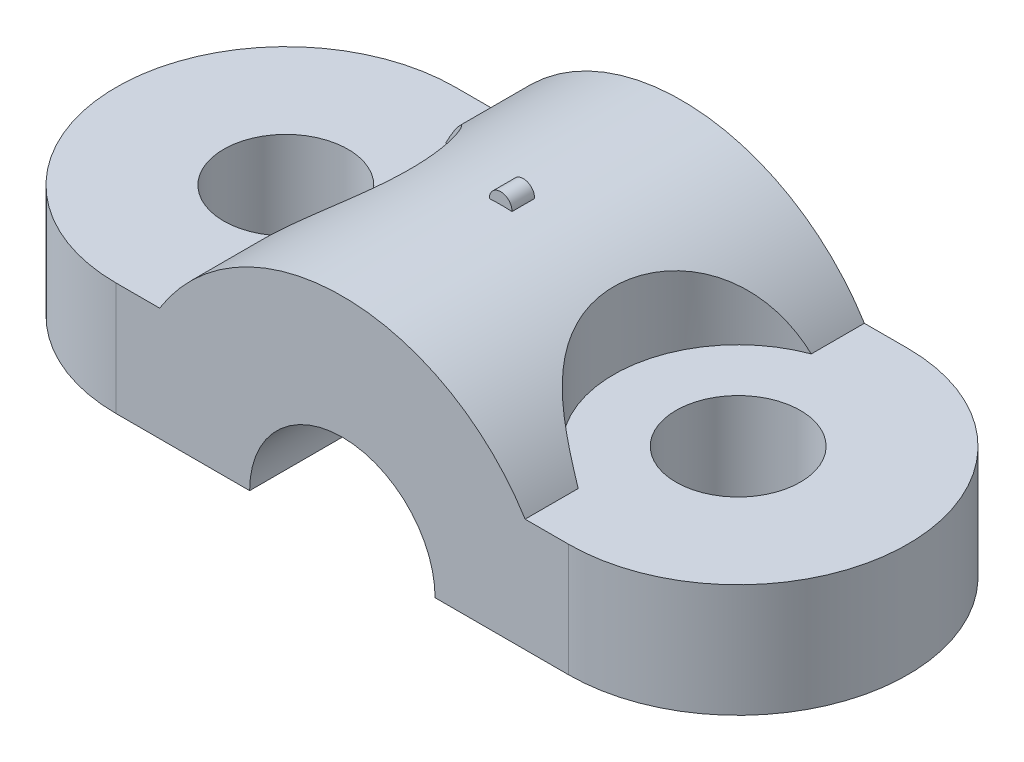
ISO-10303-21;
HEADER;
FILE_DESCRIPTION(('STEP AP214'),'2;1');
FILE_NAME('part.step','',(''),(''),'','','');
FILE_SCHEMA(('AUTOMOTIVE_DESIGN { 1 0 10303 214 1 1 1 1 }'));
ENDSEC;
DATA;
#1=APPLICATION_CONTEXT('core data for automotive mechanical design processes');
#2=APPLICATION_PROTOCOL_DEFINITION('international standard','automotive_design',2000,#1);
#3=PRODUCT_CONTEXT('',#1,'mechanical');
#4=PRODUCT('Part','Part','',(#3));
#5=PRODUCT_RELATED_PRODUCT_CATEGORY('part','',(#4));
#6=PRODUCT_DEFINITION_FORMATION('','',#4);
#7=PRODUCT_DEFINITION_CONTEXT('part definition',#1,'design');
#8=PRODUCT_DEFINITION('design','',#6,#7);
#9=PRODUCT_DEFINITION_SHAPE('','',#8);
#10=(LENGTH_UNIT() NAMED_UNIT(*) SI_UNIT(.MILLI.,.METRE.));
#11=(NAMED_UNIT(*) PLANE_ANGLE_UNIT() SI_UNIT($,.RADIAN.));
#12=(NAMED_UNIT(*) SI_UNIT($,.STERADIAN.) SOLID_ANGLE_UNIT());
#13=UNCERTAINTY_MEASURE_WITH_UNIT(LENGTH_MEASURE(1.E-05),#10,'distance_accuracy_value','');
#14=(GEOMETRIC_REPRESENTATION_CONTEXT(3) GLOBAL_UNCERTAINTY_ASSIGNED_CONTEXT((#13)) GLOBAL_UNIT_ASSIGNED_CONTEXT((#10,
#11,#12)) REPRESENTATION_CONTEXT('',''));
#15=CARTESIAN_POINT('',(0.,0.,0.));
#16=DIRECTION('',(0.,0.,1.));
#17=DIRECTION('',(1.,0.,0.));
#18=AXIS2_PLACEMENT_3D('',#15,#16,#17);
#19=CARTESIAN_POINT('',(0.,0.,0.));
#20=DIRECTION('',(0.,1.,0.));
#21=DIRECTION('',(0.,0.,1.));
#22=AXIS2_PLACEMENT_3D('',#19,#20,#21);
#23=PLANE('',#22);
#24=CARTESIAN_POINT('',(-10.,0.,0.));
#25=DIRECTION('',(0.,1.,0.));
#26=DIRECTION('',(0.,0.,1.));
#27=AXIS2_PLACEMENT_3D('',#24,#25,#26);
#28=CIRCLE('',#27,2.75);
#29=CARTESIAN_POINT('',(-10.,0.,2.75));
#30=VERTEX_POINT('',#29);
#31=EDGE_CURVE('E215',#30,#30,#28,.T.);
#32=ORIENTED_EDGE('',*,*,#31,.T.);
#33=EDGE_LOOP('',(#32));
#34=FACE_BOUND('',#33,.T.);
#35=DIRECTION('',(1.,0.,0.));
#36=VECTOR('',#35,1.);
#37=CARTESIAN_POINT('',(0.,0.,-7.5));
#38=LINE('',#37,#36);
#39=CARTESIAN_POINT('',(-10.,0.,-7.5));
#40=VERTEX_POINT('',#39);
#41=CARTESIAN_POINT('',(-4.1,0.,-7.5));
#42=VERTEX_POINT('',#41);
#43=EDGE_CURVE('E198',#40,#42,#38,.T.);
#44=ORIENTED_EDGE('',*,*,#43,.T.);
#45=DIRECTION('',(0.,0.,1.));
#46=VECTOR('',#45,1.);
#47=CARTESIAN_POINT('',(-4.1,0.,-7.5));
#48=LINE('',#47,#46);
#49=CARTESIAN_POINT('',(-4.1,0.,7.5));
#50=VERTEX_POINT('',#49);
#51=EDGE_CURVE('E147',#42,#50,#48,.T.);
#52=ORIENTED_EDGE('',*,*,#51,.T.);
#53=DIRECTION('',(1.,0.,0.));
#54=VECTOR('',#53,1.);
#55=CARTESIAN_POINT('',(0.,0.,7.5));
#56=LINE('',#55,#54);
#57=CARTESIAN_POINT('',(-10.,0.,7.5));
#58=VERTEX_POINT('',#57);
#59=EDGE_CURVE('E11',#58,#50,#56,.T.);
#60=ORIENTED_EDGE('',*,*,#59,.F.);
#61=CARTESIAN_POINT('',(-10.,0.,0.));
#62=DIRECTION('',(0.,1.,0.));
#63=DIRECTION('',(0.,0.,1.));
#64=AXIS2_PLACEMENT_3D('',#61,#62,#63);
#65=CIRCLE('',#64,7.5);
#66=EDGE_CURVE('E207',#40,#58,#65,.T.);
#67=ORIENTED_EDGE('',*,*,#66,.F.);
#68=EDGE_LOOP('',(#44,#52,#60,#67));
#69=FACE_BOUND('',#68,.T.);
#70=ADVANCED_FACE('F34',(#34,#69),#23,.F.);
#71=CARTESIAN_POINT('',(0.,9.5,-7.5));
#72=DIRECTION('',(0.,0.,-1.));
#73=DIRECTION('',(-1.,0.,0.));
#74=AXIS2_PLACEMENT_3D('',#71,#72,#73);
#75=PLANE('',#74);
#76=CARTESIAN_POINT('',(0.,0.,-7.5));
#77=DIRECTION('',(0.,0.,1.));
#78=DIRECTION('',(1.,0.,0.));
#79=AXIS2_PLACEMENT_3D('',#76,#77,#78);
#80=CIRCLE('',#79,4.1);
#81=CARTESIAN_POINT('',(4.1,0.,-7.5));
#82=VERTEX_POINT('',#81);
#83=EDGE_CURVE('E142',#82,#42,#80,.T.);
#84=ORIENTED_EDGE('',*,*,#83,.T.);
#85=ORIENTED_EDGE('',*,*,#43,.F.);
#86=DIRECTION('',(0.,-1.,0.));
#87=VECTOR('',#86,1.);
#88=CARTESIAN_POINT('',(-10.,5.,-7.5));
#89=LINE('',#88,#87);
#90=CARTESIAN_POINT('',(-10.,5.,-7.5));
#91=VERTEX_POINT('',#90);
#92=EDGE_CURVE('E208',#91,#40,#89,.T.);
#93=ORIENTED_EDGE('',*,*,#92,.F.);
#94=DIRECTION('',(1.,0.,0.));
#95=VECTOR('',#94,1.);
#96=CARTESIAN_POINT('',(0.,5.,-7.5));
#97=LINE('',#96,#95);
#98=CARTESIAN_POINT('',(-8.08,5.,-7.5));
#99=VERTEX_POINT('',#98);
#100=EDGE_CURVE('E228',#91,#99,#97,.T.);
#101=ORIENTED_EDGE('',*,*,#100,.T.);
#102=CARTESIAN_POINT('',(0.,-0.00404444444444992,-7.5));
#103=DIRECTION('',(0.,0.,1.));
#104=DIRECTION('',(1.,0.,0.));
#105=AXIS2_PLACEMENT_3D('',#102,#103,#104);
#106=CIRCLE('',#105,9.50404444444445);
#107=CARTESIAN_POINT('',(8.08,5.,-7.5));
#108=VERTEX_POINT('',#107);
#109=EDGE_CURVE('E158',#99,#108,#106,.F.);
#110=ORIENTED_EDGE('',*,*,#109,.T.);
#111=DIRECTION('',(1.,0.,0.));
#112=VECTOR('',#111,1.);
#113=CARTESIAN_POINT('',(0.,5.,-7.5));
#114=LINE('',#113,#112);
#115=CARTESIAN_POINT('',(10.,5.,-7.5));
#116=VERTEX_POINT('',#115);
#117=EDGE_CURVE('E249',#108,#116,#114,.T.);
#118=ORIENTED_EDGE('',*,*,#117,.T.);
#119=DIRECTION('',(0.,-1.,0.));
#120=VECTOR('',#119,1.);
#121=CARTESIAN_POINT('',(10.,5.,-7.5));
#122=LINE('',#121,#120);
#123=CARTESIAN_POINT('',(10.,0.,-7.5));
#124=VERTEX_POINT('',#123);
#125=EDGE_CURVE('E239',#116,#124,#122,.T.);
#126=ORIENTED_EDGE('',*,*,#125,.T.);
#127=EDGE_CURVE('E201',#82,#124,#38,.T.);
#128=ORIENTED_EDGE('',*,*,#127,.F.);
#129=EDGE_LOOP('',(#84,#85,#93,#101,#110,#118,#126,#128));
#130=FACE_BOUND('',#129,.T.);
#131=ADVANCED_FACE('F187',(#130),#75,.T.);
#132=CARTESIAN_POINT('',(0.,9.5,7.5));
#133=DIRECTION('',(0.,0.,-1.));
#134=DIRECTION('',(-1.,0.,0.));
#135=AXIS2_PLACEMENT_3D('',#132,#133,#134);
#136=PLANE('',#135);
#137=ORIENTED_EDGE('',*,*,#59,.T.);
#138=CARTESIAN_POINT('',(0.,0.,7.5));
#139=DIRECTION('',(0.,0.,1.));
#140=DIRECTION('',(1.,0.,0.));
#141=AXIS2_PLACEMENT_3D('',#138,#139,#140);
#142=CIRCLE('',#141,4.1);
#143=CARTESIAN_POINT('',(4.1,0.,7.5));
#144=VERTEX_POINT('',#143);
#145=EDGE_CURVE('E141',#144,#50,#142,.T.);
#146=ORIENTED_EDGE('',*,*,#145,.F.);
#147=CARTESIAN_POINT('',(10.,0.,7.5));
#148=VERTEX_POINT('',#147);
#149=EDGE_CURVE('E43',#144,#148,#56,.T.);
#150=ORIENTED_EDGE('',*,*,#149,.T.);
#151=DIRECTION('',(0.,-1.,0.));
#152=VECTOR('',#151,1.);
#153=CARTESIAN_POINT('',(10.,5.,7.5));
#154=LINE('',#153,#152);
#155=CARTESIAN_POINT('',(10.,5.,7.5));
#156=VERTEX_POINT('',#155);
#157=EDGE_CURVE('E220',#156,#148,#154,.T.);
#158=ORIENTED_EDGE('',*,*,#157,.F.);
#159=DIRECTION('',(1.,0.,0.));
#160=VECTOR('',#159,1.);
#161=CARTESIAN_POINT('',(0.,5.,7.5));
#162=LINE('',#161,#160);
#163=CARTESIAN_POINT('',(8.08,5.,7.5));
#164=VERTEX_POINT('',#163);
#165=EDGE_CURVE('E254',#164,#156,#162,.T.);
#166=ORIENTED_EDGE('',*,*,#165,.F.);
#167=CARTESIAN_POINT('',(0.,-0.00404444444444992,7.5));
#168=DIRECTION('',(0.,0.,1.));
#169=DIRECTION('',(1.,0.,0.));
#170=AXIS2_PLACEMENT_3D('',#167,#168,#169);
#171=CIRCLE('',#170,9.50404444444445);
#172=CARTESIAN_POINT('',(-8.08,5.,7.5));
#173=VERTEX_POINT('',#172);
#174=EDGE_CURVE('E157',#173,#164,#171,.F.);
#175=ORIENTED_EDGE('',*,*,#174,.F.);
#176=DIRECTION('',(1.,0.,0.));
#177=VECTOR('',#176,1.);
#178=CARTESIAN_POINT('',(0.,5.,7.5));
#179=LINE('',#178,#177);
#180=CARTESIAN_POINT('',(-10.,5.,7.5));
#181=VERTEX_POINT('',#180);
#182=EDGE_CURVE('E223',#181,#173,#179,.T.);
#183=ORIENTED_EDGE('',*,*,#182,.F.);
#184=DIRECTION('',(0.,-1.,0.));
#185=VECTOR('',#184,1.);
#186=CARTESIAN_POINT('',(-10.,5.,7.5));
#187=LINE('',#186,#185);
#188=EDGE_CURVE('E211',#181,#58,#187,.T.);
#189=ORIENTED_EDGE('',*,*,#188,.T.);
#190=EDGE_LOOP('',(#137,#146,#150,#158,#166,#175,#183,#189));
#191=FACE_BOUND('',#190,.T.);
#192=ADVANCED_FACE('F185',(#191),#136,.F.);
#193=CARTESIAN_POINT('',(10.,9.5,0.));
#194=DIRECTION('',(0.,-1.,0.));
#195=DIRECTION('',(0.,0.,-1.));
#196=AXIS2_PLACEMENT_3D('',#193,#194,#195);
#197=CYLINDRICAL_SURFACE('',#196,5.5);
#198=CARTESIAN_POINT('',(8.08,5.,5.1539887465923));
#199=CARTESIAN_POINT('',(7.99001563173181,5.14537029095498,5.12045202710558));
#200=CARTESIAN_POINT('',(7.89642080027451,5.2876648416954,5.08291490139109));
#201=CARTESIAN_POINT('',(7.70303619143883,5.56538729143438,4.99851462898592));
#202=CARTESIAN_POINT('',(7.60323825023025,5.70080569622129,4.95163900523841));
#203=CARTESIAN_POINT('',(7.39822899975281,5.96429797844464,4.84706858689315));
#204=CARTESIAN_POINT('',(7.29299392446025,6.09233332444659,4.78932275124168));
#205=CARTESIAN_POINT('',(7.07919423812253,6.33933866324696,4.66201228546329));
#206=CARTESIAN_POINT('',(6.97063158823109,6.4583138569845,4.59245451114239));
#207=CARTESIAN_POINT('',(6.77002561898331,6.66761599596033,4.45304749354069));
#208=CARTESIAN_POINT('',(6.67820013118659,6.75943742939677,4.38512546358434));
#209=CARTESIAN_POINT('',(6.49483287498101,6.93570850535153,4.23998448771444));
#210=CARTESIAN_POINT('',(6.4032910581131,7.02015948250038,4.16276723101617));
#211=CARTESIAN_POINT('',(6.22213791783691,7.18111426267204,3.99907706653871));
#212=CARTESIAN_POINT('',(6.13252200680799,7.25763913011599,3.91262999964637));
#213=CARTESIAN_POINT('',(5.95643697117863,7.40275908901513,3.7303687540728));
#214=CARTESIAN_POINT('',(5.86996780136252,7.47135429444287,3.63455471005909));
#215=CARTESIAN_POINT('',(5.70124719644635,7.60082296141688,3.43337170240056));
#216=CARTESIAN_POINT('',(5.61901839949237,7.66165711328524,3.32795839865091));
#217=CARTESIAN_POINT('',(5.46068184982798,7.77524301032143,3.10851985876541));
#218=CARTESIAN_POINT('',(5.38457425746823,7.8279945437903,2.99449439717768));
#219=CARTESIAN_POINT('',(5.23974783889334,7.92561771971182,2.75847560664738));
#220=CARTESIAN_POINT('',(5.17103605829657,7.97048187357141,2.63647485476747));
#221=CARTESIAN_POINT('',(5.04226321935938,8.05252280833811,2.3855256402096));
#222=CARTESIAN_POINT('',(4.98220169755516,8.08970000114394,2.25657755026534));
#223=CARTESIAN_POINT('',(4.87569571840315,8.15426707913313,2.00227913158619));
#224=CARTESIAN_POINT('',(4.82858229536027,8.18216883107698,1.87733791764317));
#225=CARTESIAN_POINT('',(4.7432772156176,8.23189039517921,1.62321717296968));
#226=CARTESIAN_POINT('',(4.70508867416853,8.25370808419313,1.49403618022434));
#227=CARTESIAN_POINT('',(4.63817572488957,8.29147622530342,1.23249757882539));
#228=CARTESIAN_POINT('',(4.60944532943068,8.30743039014418,1.10014203703577));
#229=CARTESIAN_POINT('',(4.56176669780388,8.33369431090743,0.833080930764921));
#230=CARTESIAN_POINT('',(4.5428218951031,8.34400208575988,0.698374558563418));
#231=CARTESIAN_POINT('',(4.51503828462937,8.35906135478321,0.428380394727918));
#232=CARTESIAN_POINT('',(4.50614357629464,8.36384358648628,0.293100062555013));
#233=CARTESIAN_POINT('',(4.49837528890235,8.36802222045578,0.0221690513639427));
#234=CARTESIAN_POINT('',(4.49950170082585,8.36741862756942,-0.113481627320805));
#235=CARTESIAN_POINT('',(4.51176368608058,8.36081643472608,-0.38422471554139));
#236=CARTESIAN_POINT('',(4.52290120430723,8.35481678645693,-0.519317011474745));
#237=CARTESIAN_POINT('',(4.55505038849556,8.33734097223021,-0.787916170946606));
#238=CARTESIAN_POINT('',(4.57605862016963,8.32586671101677,-0.921423569362649));
#239=CARTESIAN_POINT('',(4.62781292988375,8.29722570836424,-1.1865638287248));
#240=CARTESIAN_POINT('',(4.6586034271825,8.28003298351272,-1.31818521911614));
#241=CARTESIAN_POINT('',(4.72949049511725,8.23976776054407,-1.57792413672532));
#242=CARTESIAN_POINT('',(4.7695835890645,8.21669745875729,-1.70604295302427));
#243=CARTESIAN_POINT('',(4.85856357954256,8.16442428944372,-1.95792604850737));
#244=CARTESIAN_POINT('',(4.90745190221837,8.13522042723227,-2.0816896175919));
#245=CARTESIAN_POINT('',(5.01334827876581,8.07042458381926,-2.32395800884918));
#246=CARTESIAN_POINT('',(5.07035625249683,8.03483266566663,-2.44246288290989));
#247=CARTESIAN_POINT('',(5.19132819405616,7.95724331145843,-2.67273122361642));
#248=CARTESIAN_POINT('',(5.25525007007142,7.91528407191326,-2.7845296835744));
#249=CARTESIAN_POINT('',(5.38938362745487,7.82461791597135,-3.00141201562999));
#250=CARTESIAN_POINT('',(5.45959524542943,7.77591106758035,-3.10649595538424));
#251=CARTESIAN_POINT('',(5.6051944297775,7.67167449225916,-3.30926716864003));
#252=CARTESIAN_POINT('',(5.68057711881361,7.61615115661414,-3.40696123419716));
#253=CARTESIAN_POINT('',(5.83547574864086,7.49819261477784,-3.59465579730305));
#254=CARTESIAN_POINT('',(5.91499314997896,7.43575495724966,-3.68465354610437));
#255=CARTESIAN_POINT('',(6.07793913790115,7.30325823694817,-3.85768486544204));
#256=CARTESIAN_POINT('',(6.16140331673655,7.23311637598895,-3.94062141037416));
#257=CARTESIAN_POINT('',(6.33012485404885,7.086012440228,-4.09821250960134));
#258=CARTESIAN_POINT('',(6.41538237096791,7.00904976085756,-4.17286632842706));
#259=CARTESIAN_POINT('',(6.58670164493307,6.84840333431155,-4.31413384543037));
#260=CARTESIAN_POINT('',(6.67276477776184,6.76470488678345,-4.38072911800364));
#261=CARTESIAN_POINT('',(6.84439122105345,6.59111047836797,-4.50593131531683));
#262=CARTESIAN_POINT('',(6.92995461226864,6.50121555060063,-4.56453956688047));
#263=CARTESIAN_POINT('',(7.11039937051045,6.30381993408541,-4.68115048657111));
#264=CARTESIAN_POINT('',(7.20508286045697,6.1955337381665,-4.73812944608902));
#265=CARTESIAN_POINT('',(7.39139372656363,5.97218594834049,-4.84320317212035));
#266=CARTESIAN_POINT('',(7.48302002866022,5.85712201170591,-4.8912948426942));
#267=CARTESIAN_POINT('',(7.66177586574647,5.62141615772103,-4.97921645036869));
#268=CARTESIAN_POINT('',(7.74892334902326,5.50080089762206,-5.01908167299271));
#269=CARTESIAN_POINT('',(7.91830939750818,5.2542538569602,-5.0916615235222));
#270=CARTESIAN_POINT('',(8.00055221110987,5.12832684372751,-5.12438240717257));
#271=CARTESIAN_POINT('',(8.08,5.,-5.15398874659229));
#272=B_SPLINE_CURVE_WITH_KNOTS('',3,(#198,#199,#200,#201,#202,#203,#204,#205,#206,#207,#208,
#209,#210,#211,#212,#213,#214,#215,#216,#217,#218,#219,#220,#221,#222,#223,#224,#225,#226,#227,
#228,#229,#230,#231,#232,#233,#234,#235,#236,#237,#238,#239,#240,#241,#242,#243,#244,#245,#246,
#247,#248,#249,#250,#251,#252,#253,#254,#255,#256,#257,#258,#259,#260,#261,#262,#263,#264,#265,
#266,#267,#268,#269,#270,#271),.UNSPECIFIED.,.F.,.F.,(4,2,2,2,2,2,2,2,2,2,2,2,2,2,2,2,2,2,2,2,2,
2,2,2,2,2,2,2,2,2,2,2,2,2,2,2,4),(0.,0.522671156148208,1.04604538796136,1.57194135890126,
2.09753312963723,2.5367327541687,2.97585268340231,3.41377393017173,3.85168888194289,
4.29174054629022,4.73180373444884,5.17228250589281,5.61273766856725,6.02148927877775,
6.430383352304,6.83901806893623,7.24779606584504,7.65428899213027,8.06078155257461,
8.46735310093515,8.87378329671269,9.28208603941171,9.69023643093759,10.0984530637356,
10.5066656677327,10.9125197880747,11.3183698183164,11.7238421801669,12.1294587572976,
12.5399647620607,12.9505071888116,13.3619712478386,13.7733668698959,14.237049740574,
14.7008938346784,15.1627050054456,15.624110167645),.UNSPECIFIED.);
#273=CARTESIAN_POINT('',(8.08,5.,5.15398874659229));
#274=VERTEX_POINT('',#273);
#275=CARTESIAN_POINT('',(8.08,5.,-5.15398874659229));
#276=VERTEX_POINT('',#275);
#277=EDGE_CURVE('E150',#274,#276,#272,.T.);
#278=ORIENTED_EDGE('',*,*,#277,.F.);
#279=CARTESIAN_POINT('',(10.,5.,0.));
#280=DIRECTION('',(0.,1.,0.));
#281=DIRECTION('',(0.,0.,1.));
#282=AXIS2_PLACEMENT_3D('',#279,#280,#281);
#283=CIRCLE('',#282,5.5);
#284=EDGE_CURVE('E257',#276,#274,#283,.T.);
#285=ORIENTED_EDGE('',*,*,#284,.F.);
#286=EDGE_LOOP('',(#278,#285));
#287=FACE_BOUND('',#286,.T.);
#288=ADVANCED_FACE('F36',(#287),#197,.F.);
#289=CARTESIAN_POINT('',(-10.,9.5,0.));
#290=DIRECTION('',(0.,-1.,0.));
#291=DIRECTION('',(0.,0.,-1.));
#292=AXIS2_PLACEMENT_3D('',#289,#290,#291);
#293=CYLINDRICAL_SURFACE('',#292,5.5);
#294=CARTESIAN_POINT('',(-8.08,5.,-5.15398874659229));
#295=CARTESIAN_POINT('',(-7.99001563173182,5.14537029095499,-5.12045202710558));
#296=CARTESIAN_POINT('',(-7.89642080027452,5.28766484169541,-5.08291490139109));
#297=CARTESIAN_POINT('',(-7.70303619143883,5.56538729143438,-4.99851462898592));
#298=CARTESIAN_POINT('',(-7.60323825023026,5.7008056962213,-4.95163900523841));
#299=CARTESIAN_POINT('',(-7.39822899975281,5.96429797844465,-4.84706858689314));
#300=CARTESIAN_POINT('',(-7.29299392446025,6.09233332444659,-4.78932275124168));
#301=CARTESIAN_POINT('',(-7.07919423812253,6.33933866324696,-4.66201228546328));
#302=CARTESIAN_POINT('',(-6.9706315882311,6.45831385698451,-4.59245451114239));
#303=CARTESIAN_POINT('',(-6.77002561898331,6.66761599596033,-4.45304749354069));
#304=CARTESIAN_POINT('',(-6.67820013118659,6.75943742939678,-4.38512546358434));
#305=CARTESIAN_POINT('',(-6.49483287498101,6.93570850535153,-4.23998448771444));
#306=CARTESIAN_POINT('',(-6.4032910581131,7.02015948250038,-4.16276723101617));
#307=CARTESIAN_POINT('',(-6.22213791783691,7.18111426267204,-3.9990770665387));
#308=CARTESIAN_POINT('',(-6.13252200680799,7.25763913011599,-3.91262999964637));
#309=CARTESIAN_POINT('',(-5.95643697117864,7.40275908901513,-3.7303687540728));
#310=CARTESIAN_POINT('',(-5.86996780136253,7.47135429444287,-3.63455471005909));
#311=CARTESIAN_POINT('',(-5.70124719644635,7.60082296141688,-3.43337170240056));
#312=CARTESIAN_POINT('',(-5.61901839949237,7.66165711328524,-3.32795839865091));
#313=CARTESIAN_POINT('',(-5.46068184982799,7.77524301032144,-3.10851985876541));
#314=CARTESIAN_POINT('',(-5.38457425746824,7.8279945437903,-2.99449439717768));
#315=CARTESIAN_POINT('',(-5.23974783889334,7.92561771971182,-2.75847560664738));
#316=CARTESIAN_POINT('',(-5.17103605829658,7.97048187357141,-2.63647485476747));
#317=CARTESIAN_POINT('',(-5.04226321935938,8.05252280833811,-2.3855256402096));
#318=CARTESIAN_POINT('',(-4.98220169755516,8.08970000114394,-2.25657755026534));
#319=CARTESIAN_POINT('',(-4.87569571840315,8.15426707913313,-2.0022791315862));
#320=CARTESIAN_POINT('',(-4.82858229536027,8.18216883107698,-1.87733791764317));
#321=CARTESIAN_POINT('',(-4.74327721561761,8.23189039517922,-1.62321717296969));
#322=CARTESIAN_POINT('',(-4.70508867416853,8.25370808419313,-1.49403618022434));
#323=CARTESIAN_POINT('',(-4.63817572488957,8.29147622530342,-1.2324975788254));
#324=CARTESIAN_POINT('',(-4.60944532943068,8.30743039014418,-1.10014203703578));
#325=CARTESIAN_POINT('',(-4.56176669780389,8.33369431090743,-0.833080930764929));
#326=CARTESIAN_POINT('',(-4.5428218951031,8.34400208575988,-0.698374558563427));
#327=CARTESIAN_POINT('',(-4.51503828462937,8.35906135478321,-0.428380394727927));
#328=CARTESIAN_POINT('',(-4.50614357629464,8.36384358648628,-0.293100062555022));
#329=CARTESIAN_POINT('',(-4.49837528890235,8.36802222045578,-0.0221690513639521));
#330=CARTESIAN_POINT('',(-4.49950170082585,8.36741862756942,0.113481627320795));
#331=CARTESIAN_POINT('',(-4.51176368608058,8.36081643472609,0.384224715541381));
#332=CARTESIAN_POINT('',(-4.52290120430723,8.35481678645693,0.519317011474737));
#333=CARTESIAN_POINT('',(-4.55505038849556,8.33734097223022,0.787916170946599));
#334=CARTESIAN_POINT('',(-4.57605862016964,8.32586671101678,0.921423569362642));
#335=CARTESIAN_POINT('',(-4.62781292988375,8.29722570836424,1.18656382872479));
#336=CARTESIAN_POINT('',(-4.6586034271825,8.28003298351273,1.31818521911613));
#337=CARTESIAN_POINT('',(-4.72949049511725,8.23976776054407,1.57792413672531));
#338=CARTESIAN_POINT('',(-4.7695835890645,8.21669745875729,1.70604295302426));
#339=CARTESIAN_POINT('',(-4.85856357954256,8.16442428944372,1.95792604850737));
#340=CARTESIAN_POINT('',(-4.90745190221837,8.13522042723227,2.08168961759189));
#341=CARTESIAN_POINT('',(-5.01334827876581,8.07042458381927,2.32395800884917));
#342=CARTESIAN_POINT('',(-5.07035625249683,8.03483266566664,2.44246288290988));
#343=CARTESIAN_POINT('',(-5.19132819405616,7.95724331145843,2.67273122361641));
#344=CARTESIAN_POINT('',(-5.25525007007141,7.91528407191326,2.7845296835744));
#345=CARTESIAN_POINT('',(-5.38938362745487,7.82461791597136,3.00141201562998));
#346=CARTESIAN_POINT('',(-5.45959524542943,7.77591106758036,3.10649595538423));
#347=CARTESIAN_POINT('',(-5.6051944297775,7.67167449225917,3.30926716864003));
#348=CARTESIAN_POINT('',(-5.68057711881361,7.61615115661414,3.40696123419715));
#349=CARTESIAN_POINT('',(-5.83547574864086,7.49819261477785,3.59465579730305));
#350=CARTESIAN_POINT('',(-5.91499314997896,7.43575495724967,3.68465354610436));
#351=CARTESIAN_POINT('',(-6.07793913790115,7.30325823694818,3.85768486544203));
#352=CARTESIAN_POINT('',(-6.16140331673655,7.23311637598896,3.94062141037416));
#353=CARTESIAN_POINT('',(-6.33012485404885,7.086012440228,4.09821250960133));
#354=CARTESIAN_POINT('',(-6.4153823709679,7.00904976085757,4.17286632842706));
#355=CARTESIAN_POINT('',(-6.58670164493307,6.84840333431156,4.31413384543037));
#356=CARTESIAN_POINT('',(-6.67276477776184,6.76470488678345,4.38072911800364));
#357=CARTESIAN_POINT('',(-6.84439122105345,6.59111047836798,4.50593131531683));
#358=CARTESIAN_POINT('',(-6.92995461226863,6.50121555060064,4.56453956688047));
#359=CARTESIAN_POINT('',(-7.11039937051045,6.30381993408542,4.68115048657111));
#360=CARTESIAN_POINT('',(-7.20508286045697,6.19553373816651,4.73812944608902));
#361=CARTESIAN_POINT('',(-7.39139372656363,5.9721859483405,4.84320317212035));
#362=CARTESIAN_POINT('',(-7.48302002866022,5.85712201170592,4.8912948426942));
#363=CARTESIAN_POINT('',(-7.66177586574647,5.62141615772104,4.97921645036869));
#364=CARTESIAN_POINT('',(-7.74892334902326,5.50080089762206,5.01908167299271));
#365=CARTESIAN_POINT('',(-7.91830939750818,5.25425385696021,5.0916615235222));
#366=CARTESIAN_POINT('',(-8.00055221110987,5.12832684372751,5.12438240717257));
#367=CARTESIAN_POINT('',(-8.08,5.,5.15398874659229));
#368=B_SPLINE_CURVE_WITH_KNOTS('',3,(#294,#295,#296,#297,#298,#299,#300,#301,#302,#303,#304,
#305,#306,#307,#308,#309,#310,#311,#312,#313,#314,#315,#316,#317,#318,#319,#320,#321,#322,#323,
#324,#325,#326,#327,#328,#329,#330,#331,#332,#333,#334,#335,#336,#337,#338,#339,#340,#341,#342,
#343,#344,#345,#346,#347,#348,#349,#350,#351,#352,#353,#354,#355,#356,#357,#358,#359,#360,#361,
#362,#363,#364,#365,#366,#367),.UNSPECIFIED.,.F.,.F.,(4,2,2,2,2,2,2,2,2,2,2,2,2,2,2,2,2,2,2,2,2,
2,2,2,2,2,2,2,2,2,2,2,2,2,2,2,4),(0.,0.522671156148207,1.04604538796136,1.57194135890126,
2.09753312963723,2.53673275416869,2.9758526834023,3.41377393017173,3.85168888194288,
4.29174054629021,4.73180373444883,5.1722825058928,5.61273766856724,6.02148927877773,
6.43038335230398,6.83901806893622,7.24779606584503,7.65428899213026,8.0607815525746,
8.46735310093514,8.87378329671268,9.2820860394117,9.69023643093758,10.0984530637356,
10.5066656677327,10.9125197880747,11.3183698183164,11.7238421801669,12.1294587572976,
12.5399647620607,12.9505071888116,13.3619712478386,13.7733668698959,14.237049740574,
14.7008938346784,15.1627050054456,15.624110167645),.UNSPECIFIED.);
#369=CARTESIAN_POINT('',(-8.08,5.,-5.15398874659229));
#370=VERTEX_POINT('',#369);
#371=CARTESIAN_POINT('',(-8.08,5.,5.15398874659229));
#372=VERTEX_POINT('',#371);
#373=EDGE_CURVE('E170',#370,#372,#368,.T.);
#374=ORIENTED_EDGE('',*,*,#373,.F.);
#375=CARTESIAN_POINT('',(-10.,5.,0.));
#376=DIRECTION('',(0.,1.,0.));
#377=DIRECTION('',(0.,0.,1.));
#378=AXIS2_PLACEMENT_3D('',#375,#376,#377);
#379=CIRCLE('',#378,5.5);
#380=EDGE_CURVE('E233',#372,#370,#379,.T.);
#381=ORIENTED_EDGE('',*,*,#380,.F.);
#382=EDGE_LOOP('',(#374,#381));
#383=FACE_BOUND('',#382,.T.);
#384=ADVANCED_FACE('F179',(#383),#293,.F.);
#385=ORIENTED_EDGE('',*,*,#149,.F.);
#386=DIRECTION('',(0.,0.,1.));
#387=VECTOR('',#386,1.);
#388=CARTESIAN_POINT('',(4.1,0.,-7.5));
#389=LINE('',#388,#387);
#390=EDGE_CURVE('E145',#82,#144,#389,.T.);
#391=ORIENTED_EDGE('',*,*,#390,.F.);
#392=ORIENTED_EDGE('',*,*,#127,.T.);
#393=CARTESIAN_POINT('',(10.,0.,0.));
#394=DIRECTION('',(0.,1.,0.));
#395=DIRECTION('',(0.,0.,1.));
#396=AXIS2_PLACEMENT_3D('',#393,#394,#395);
#397=CIRCLE('',#396,7.5);
#398=EDGE_CURVE('E176',#148,#124,#397,.T.);
#399=ORIENTED_EDGE('',*,*,#398,.F.);
#400=EDGE_LOOP('',(#385,#391,#392,#399));
#401=FACE_BOUND('',#400,.T.);
#402=CARTESIAN_POINT('',(10.,0.,0.));
#403=DIRECTION('',(0.,1.,0.));
#404=DIRECTION('',(0.,0.,1.));
#405=AXIS2_PLACEMENT_3D('',#402,#403,#404);
#406=CIRCLE('',#405,2.75);
#407=CARTESIAN_POINT('',(10.,0.,2.75));
#408=VERTEX_POINT('',#407);
#409=EDGE_CURVE('E242',#408,#408,#406,.T.);
#410=ORIENTED_EDGE('',*,*,#409,.T.);
#411=EDGE_LOOP('',(#410));
#412=FACE_BOUND('',#411,.T.);
#413=ADVANCED_FACE('F183',(#401,#412),#23,.F.);
#414=CARTESIAN_POINT('',(-10.,5.,0.));
#415=DIRECTION('',(0.,-1.,0.));
#416=DIRECTION('',(0.,0.,-1.));
#417=AXIS2_PLACEMENT_3D('',#414,#415,#416);
#418=CYLINDRICAL_SURFACE('',#417,7.5);
#419=ORIENTED_EDGE('',*,*,#66,.T.);
#420=ORIENTED_EDGE('',*,*,#188,.F.);
#421=CARTESIAN_POINT('',(-10.,5.,0.));
#422=DIRECTION('',(0.,1.,0.));
#423=DIRECTION('',(0.,0.,1.));
#424=AXIS2_PLACEMENT_3D('',#421,#422,#423);
#425=CIRCLE('',#424,7.5);
#426=EDGE_CURVE('E226',#91,#181,#425,.T.);
#427=ORIENTED_EDGE('',*,*,#426,.F.);
#428=ORIENTED_EDGE('',*,*,#92,.T.);
#429=EDGE_LOOP('',(#419,#420,#427,#428));
#430=FACE_BOUND('',#429,.T.);
#431=ADVANCED_FACE('F283',(#430),#418,.T.);
#432=CARTESIAN_POINT('',(-10.,5.,0.));
#433=DIRECTION('',(0.,-1.,0.));
#434=DIRECTION('',(0.,0.,-1.));
#435=AXIS2_PLACEMENT_3D('',#432,#433,#434);
#436=CYLINDRICAL_SURFACE('',#435,2.75);
#437=CARTESIAN_POINT('',(-10.,5.,0.));
#438=DIRECTION('',(0.,1.,0.));
#439=DIRECTION('',(0.,0.,1.));
#440=AXIS2_PLACEMENT_3D('',#437,#438,#439);
#441=CIRCLE('',#440,2.75);
#442=CARTESIAN_POINT('',(-10.,5.,2.75));
#443=VERTEX_POINT('',#442);
#444=EDGE_CURVE('E214',#443,#443,#441,.T.);
#445=ORIENTED_EDGE('',*,*,#444,.T.);
#446=EDGE_LOOP('',(#445));
#447=FACE_BOUND('',#446,.T.);
#448=ORIENTED_EDGE('',*,*,#31,.F.);
#449=EDGE_LOOP('',(#448));
#450=FACE_BOUND('',#449,.T.);
#451=ADVANCED_FACE('F291',(#447,#450),#436,.F.);
#452=CARTESIAN_POINT('',(0.,5.,0.));
#453=DIRECTION('',(0.,1.,0.));
#454=DIRECTION('',(0.,0.,1.));
#455=AXIS2_PLACEMENT_3D('',#452,#453,#454);
#456=PLANE('',#455);
#457=ORIENTED_EDGE('',*,*,#444,.F.);
#458=EDGE_LOOP('',(#457));
#459=FACE_BOUND('',#458,.T.);
#460=DIRECTION('',(0.,0.,1.));
#461=VECTOR('',#460,1.);
#462=CARTESIAN_POINT('',(-8.08,5.,0.));
#463=LINE('',#462,#461);
#464=EDGE_CURVE('E218',#372,#173,#463,.T.);
#465=ORIENTED_EDGE('',*,*,#464,.F.);
#466=ORIENTED_EDGE('',*,*,#380,.T.);
#467=DIRECTION('',(0.,0.,1.));
#468=VECTOR('',#467,1.);
#469=CARTESIAN_POINT('',(-8.08,5.,0.));
#470=LINE('',#469,#468);
#471=EDGE_CURVE('E231',#99,#370,#470,.T.);
#472=ORIENTED_EDGE('',*,*,#471,.F.);
#473=ORIENTED_EDGE('',*,*,#100,.F.);
#474=ORIENTED_EDGE('',*,*,#426,.T.);
#475=ORIENTED_EDGE('',*,*,#182,.T.);
#476=EDGE_LOOP('',(#465,#466,#472,#473,#474,#475));
#477=FACE_BOUND('',#476,.T.);
#478=ADVANCED_FACE('F299',(#459,#477),#456,.T.);
#479=CARTESIAN_POINT('',(10.,5.,0.));
#480=DIRECTION('',(0.,-1.,0.));
#481=DIRECTION('',(0.,0.,-1.));
#482=AXIS2_PLACEMENT_3D('',#479,#480,#481);
#483=CYLINDRICAL_SURFACE('',#482,7.5);
#484=ORIENTED_EDGE('',*,*,#398,.T.);
#485=ORIENTED_EDGE('',*,*,#125,.F.);
#486=CARTESIAN_POINT('',(10.,5.,0.));
#487=DIRECTION('',(0.,1.,0.));
#488=DIRECTION('',(0.,0.,1.));
#489=AXIS2_PLACEMENT_3D('',#486,#487,#488);
#490=CIRCLE('',#489,7.5);
#491=EDGE_CURVE('E252',#156,#116,#490,.T.);
#492=ORIENTED_EDGE('',*,*,#491,.F.);
#493=ORIENTED_EDGE('',*,*,#157,.T.);
#494=EDGE_LOOP('',(#484,#485,#492,#493));
#495=FACE_BOUND('',#494,.T.);
#496=ADVANCED_FACE('F307',(#495),#483,.T.);
#497=CARTESIAN_POINT('',(10.,5.,0.));
#498=DIRECTION('',(0.,-1.,0.));
#499=DIRECTION('',(0.,0.,-1.));
#500=AXIS2_PLACEMENT_3D('',#497,#498,#499);
#501=CYLINDRICAL_SURFACE('',#500,2.75);
#502=CARTESIAN_POINT('',(10.,5.,0.));
#503=DIRECTION('',(0.,1.,0.));
#504=DIRECTION('',(0.,0.,1.));
#505=AXIS2_PLACEMENT_3D('',#502,#503,#504);
#506=CIRCLE('',#505,2.75);
#507=CARTESIAN_POINT('',(10.,5.,2.75));
#508=VERTEX_POINT('',#507);
#509=EDGE_CURVE('E241',#508,#508,#506,.T.);
#510=ORIENTED_EDGE('',*,*,#509,.T.);
#511=EDGE_LOOP('',(#510));
#512=FACE_BOUND('',#511,.T.);
#513=ORIENTED_EDGE('',*,*,#409,.F.);
#514=EDGE_LOOP('',(#513));
#515=FACE_BOUND('',#514,.T.);
#516=ADVANCED_FACE('F315',(#512,#515),#501,.F.);
#517=CARTESIAN_POINT('',(0.,5.,0.));
#518=DIRECTION('',(0.,1.,0.));
#519=DIRECTION('',(0.,0.,1.));
#520=AXIS2_PLACEMENT_3D('',#517,#518,#519);
#521=PLANE('',#520);
#522=ORIENTED_EDGE('',*,*,#509,.F.);
#523=EDGE_LOOP('',(#522));
#524=FACE_BOUND('',#523,.T.);
#525=DIRECTION('',(0.,0.,1.));
#526=VECTOR('',#525,1.);
#527=CARTESIAN_POINT('',(8.08,5.,0.));
#528=LINE('',#527,#526);
#529=EDGE_CURVE('E177',#108,#276,#528,.T.);
#530=ORIENTED_EDGE('',*,*,#529,.T.);
#531=ORIENTED_EDGE('',*,*,#284,.T.);
#532=DIRECTION('',(0.,0.,-1.));
#533=VECTOR('',#532,1.);
#534=CARTESIAN_POINT('',(8.08,5.,0.));
#535=LINE('',#534,#533);
#536=EDGE_CURVE('E256',#164,#274,#535,.T.);
#537=ORIENTED_EDGE('',*,*,#536,.F.);
#538=ORIENTED_EDGE('',*,*,#165,.T.);
#539=ORIENTED_EDGE('',*,*,#491,.T.);
#540=ORIENTED_EDGE('',*,*,#117,.F.);
#541=EDGE_LOOP('',(#530,#531,#537,#538,#539,#540));
#542=FACE_BOUND('',#541,.T.);
#543=ADVANCED_FACE('F165',(#524,#542),#521,.T.);
#544=CARTESIAN_POINT('',(0.,-0.00404444444444992,-7.5));
#545=DIRECTION('',(0.,0.,1.));
#546=DIRECTION('',(1.,0.,0.));
#547=AXIS2_PLACEMENT_3D('',#544,#545,#546);
#548=CYLINDRICAL_SURFACE('',#547,9.50404444444445);
#549=DIRECTION('',(0.,0.,-1.));
#550=VECTOR('',#549,1.);
#551=CARTESIAN_POINT('',(0.499826987192359,9.48684770460295,0.5));
#552=LINE('',#551,#550);
#553=CARTESIAN_POINT('',(0.499826987192355,9.48684770460295,0.5));
#554=VERTEX_POINT('',#553);
#555=CARTESIAN_POINT('',(0.499826987192359,9.48684770460295,-0.5));
#556=VERTEX_POINT('',#555);
#557=EDGE_CURVE('E55',#554,#556,#552,.T.);
#558=ORIENTED_EDGE('',*,*,#557,.F.);
#559=CARTESIAN_POINT('',(0.,-0.00404444444444992,0.5));
#560=DIRECTION('',(0.,0.,1.));
#561=DIRECTION('',(1.,0.,0.));
#562=AXIS2_PLACEMENT_3D('',#559,#560,#561);
#563=CIRCLE('',#562,9.50404444444445);
#564=CARTESIAN_POINT('',(-0.499826987192359,9.48684770460295,0.5));
#565=VERTEX_POINT('',#564);
#566=EDGE_CURVE('E50',#554,#565,#563,.T.);
#567=ORIENTED_EDGE('',*,*,#566,.T.);
#568=DIRECTION('',(0.,0.,-1.));
#569=VECTOR('',#568,1.);
#570=CARTESIAN_POINT('',(-0.499826987192363,9.48684770460295,0.5));
#571=LINE('',#570,#569);
#572=CARTESIAN_POINT('',(-0.499826987192363,9.48684770460295,-0.5));
#573=VERTEX_POINT('',#572);
#574=EDGE_CURVE('E121',#565,#573,#571,.T.);
#575=ORIENTED_EDGE('',*,*,#574,.T.);
#576=CARTESIAN_POINT('',(0.,-0.00404444444444992,-0.5));
#577=DIRECTION('',(0.,0.,1.));
#578=DIRECTION('',(1.,0.,0.));
#579=AXIS2_PLACEMENT_3D('',#576,#577,#578);
#580=CIRCLE('',#579,9.50404444444445);
#581=EDGE_CURVE('E126',#556,#573,#580,.T.);
#582=ORIENTED_EDGE('',*,*,#581,.F.);
#583=EDGE_LOOP('',(#558,#567,#575,#582));
#584=FACE_BOUND('',#583,.T.);
#585=ORIENTED_EDGE('',*,*,#373,.T.);
#586=ORIENTED_EDGE('',*,*,#464,.T.);
#587=ORIENTED_EDGE('',*,*,#174,.T.);
#588=ORIENTED_EDGE('',*,*,#536,.T.);
#589=ORIENTED_EDGE('',*,*,#277,.T.);
#590=ORIENTED_EDGE('',*,*,#529,.F.);
#591=ORIENTED_EDGE('',*,*,#109,.F.);
#592=ORIENTED_EDGE('',*,*,#471,.T.);
#593=EDGE_LOOP('',(#585,#586,#587,#588,#589,#590,#591,#592));
#594=FACE_BOUND('',#593,.T.);
#595=ADVANCED_FACE('F123',(#584,#594),#548,.T.);
#596=CARTESIAN_POINT('',(0.,0.,-7.5));
#597=DIRECTION('',(0.,0.,1.));
#598=DIRECTION('',(1.,0.,0.));
#599=AXIS2_PLACEMENT_3D('',#596,#597,#598);
#600=CYLINDRICAL_SURFACE('',#599,4.1);
#601=ORIENTED_EDGE('',*,*,#145,.T.);
#602=ORIENTED_EDGE('',*,*,#51,.F.);
#603=ORIENTED_EDGE('',*,*,#83,.F.);
#604=ORIENTED_EDGE('',*,*,#390,.T.);
#605=EDGE_LOOP('',(#601,#602,#603,#604));
#606=FACE_BOUND('',#605,.T.);
#607=ADVANCED_FACE('F164',(#606),#600,.F.);
#608=CARTESIAN_POINT('',(0.,9.5,0.5));
#609=DIRECTION('',(0.,0.,-1.));
#610=DIRECTION('',(-1.,0.,0.));
#611=AXIS2_PLACEMENT_3D('',#608,#609,#610);
#612=CYLINDRICAL_SURFACE('',#611,0.5);
#613=CARTESIAN_POINT('',(0.,9.5,-0.5));
#614=DIRECTION('',(0.,0.,1.));
#615=DIRECTION('',(1.,0.,0.));
#616=AXIS2_PLACEMENT_3D('',#613,#614,#615);
#617=CIRCLE('',#616,0.5);
#618=EDGE_CURVE('E131',#556,#573,#617,.T.);
#619=ORIENTED_EDGE('',*,*,#618,.T.);
#620=ORIENTED_EDGE('',*,*,#574,.F.);
#621=CARTESIAN_POINT('',(0.,9.5,0.5));
#622=DIRECTION('',(0.,0.,1.));
#623=DIRECTION('',(1.,0.,0.));
#624=AXIS2_PLACEMENT_3D('',#621,#622,#623);
#625=CIRCLE('',#624,0.5);
#626=EDGE_CURVE('E128',#554,#565,#625,.T.);
#627=ORIENTED_EDGE('',*,*,#626,.F.);
#628=ORIENTED_EDGE('',*,*,#557,.T.);
#629=EDGE_LOOP('',(#619,#620,#627,#628));
#630=FACE_BOUND('',#629,.T.);
#631=ADVANCED_FACE('F132',(#630),#612,.T.);
#632=CARTESIAN_POINT('',(0.,0.,0.5));
#633=DIRECTION('',(0.,0.,1.));
#634=DIRECTION('',(1.,0.,0.));
#635=AXIS2_PLACEMENT_3D('',#632,#633,#634);
#636=PLANE('',#635);
#637=ORIENTED_EDGE('',*,*,#566,.F.);
#638=ORIENTED_EDGE('',*,*,#626,.T.);
#639=EDGE_LOOP('',(#637,#638));
#640=FACE_BOUND('',#639,.T.);
#641=ADVANCED_FACE('F344',(#640),#636,.T.);
#642=CARTESIAN_POINT('',(0.,0.,-0.5));
#643=DIRECTION('',(0.,0.,1.));
#644=DIRECTION('',(1.,0.,0.));
#645=AXIS2_PLACEMENT_3D('',#642,#643,#644);
#646=PLANE('',#645);
#647=ORIENTED_EDGE('',*,*,#581,.T.);
#648=ORIENTED_EDGE('',*,*,#618,.F.);
#649=EDGE_LOOP('',(#647,#648));
#650=FACE_BOUND('',#649,.T.);
#651=ADVANCED_FACE('F135',(#650),#646,.F.);
#652=CLOSED_SHELL('',(#70,#131,#192,#288,#384,#413,#431,#451,#478,#496,#516,#543,#595,#607,#631,
#641,#651));
#653=MANIFOLD_SOLID_BREP('B2',#652);
#654=ADVANCED_BREP_SHAPE_REPRESENTATION('',(#18,#653),#14);
#655=SHAPE_DEFINITION_REPRESENTATION(#9,#654);
ENDSEC;
END-ISO-10303-21;
